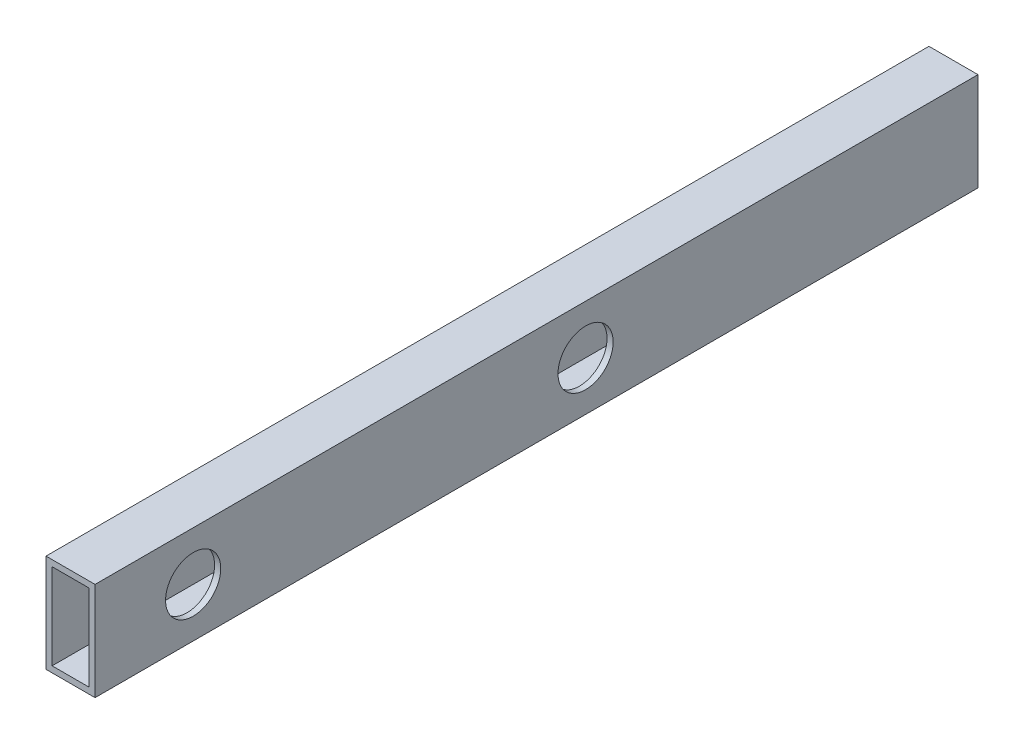
ISO-10303-21;
HEADER;
FILE_DESCRIPTION(('STEP AP214'),'2;1');
FILE_NAME('part.step','',(''),(''),'','','');
FILE_SCHEMA(('AUTOMOTIVE_DESIGN { 1 0 10303 214 1 1 1 1 }'));
ENDSEC;
DATA;
#1=APPLICATION_CONTEXT('core data for automotive mechanical design processes');
#2=APPLICATION_PROTOCOL_DEFINITION('international standard','automotive_design',2000,#1);
#3=PRODUCT_CONTEXT('',#1,'mechanical');
#4=PRODUCT('Part','Part','',(#3));
#5=PRODUCT_RELATED_PRODUCT_CATEGORY('part','',(#4));
#6=PRODUCT_DEFINITION_FORMATION('','',#4);
#7=PRODUCT_DEFINITION_CONTEXT('part definition',#1,'design');
#8=PRODUCT_DEFINITION('design','',#6,#7);
#9=PRODUCT_DEFINITION_SHAPE('','',#8);
#10=(LENGTH_UNIT() NAMED_UNIT(*) SI_UNIT(.MILLI.,.METRE.));
#11=(NAMED_UNIT(*) PLANE_ANGLE_UNIT() SI_UNIT($,.RADIAN.));
#12=(NAMED_UNIT(*) SI_UNIT($,.STERADIAN.) SOLID_ANGLE_UNIT());
#13=UNCERTAINTY_MEASURE_WITH_UNIT(LENGTH_MEASURE(1.E-05),#10,'distance_accuracy_value','');
#14=(GEOMETRIC_REPRESENTATION_CONTEXT(3) GLOBAL_UNCERTAINTY_ASSIGNED_CONTEXT((#13)) GLOBAL_UNIT_ASSIGNED_CONTEXT((#10,
#11,#12)) REPRESENTATION_CONTEXT('',''));
#15=CARTESIAN_POINT('',(0.,0.,0.));
#16=DIRECTION('',(0.,0.,1.));
#17=DIRECTION('',(1.,0.,0.));
#18=AXIS2_PLACEMENT_3D('',#15,#16,#17);
#19=CARTESIAN_POINT('',(0.,0.,457.2));
#20=DIRECTION('',(0.,0.,-1.));
#21=DIRECTION('',(-1.,0.,0.));
#22=AXIS2_PLACEMENT_3D('',#19,#20,#21);
#23=PLANE('',#22);
#24=DIRECTION('',(0.,-1.,0.));
#25=VECTOR('',#24,1.);
#26=CARTESIAN_POINT('',(0.,0.,457.2));
#27=LINE('',#26,#25);
#28=CARTESIAN_POINT('',(0.,50.8,457.2));
#29=VERTEX_POINT('',#28);
#30=CARTESIAN_POINT('',(0.,0.,457.2));
#31=VERTEX_POINT('',#30);
#32=EDGE_CURVE('E138',#29,#31,#27,.T.);
#33=ORIENTED_EDGE('',*,*,#32,.T.);
#34=DIRECTION('',(1.,0.,0.));
#35=VECTOR('',#34,1.);
#36=CARTESIAN_POINT('',(0.,0.,457.2));
#37=LINE('',#36,#35);
#38=CARTESIAN_POINT('',(25.4,0.,457.2));
#39=VERTEX_POINT('',#38);
#40=EDGE_CURVE('E141',#31,#39,#37,.T.);
#41=ORIENTED_EDGE('',*,*,#40,.T.);
#42=DIRECTION('',(0.,1.,0.));
#43=VECTOR('',#42,1.);
#44=CARTESIAN_POINT('',(25.4,0.,457.2));
#45=LINE('',#44,#43);
#46=CARTESIAN_POINT('',(25.4,50.8,457.2));
#47=VERTEX_POINT('',#46);
#48=EDGE_CURVE('E144',#39,#47,#45,.T.);
#49=ORIENTED_EDGE('',*,*,#48,.T.);
#50=DIRECTION('',(-1.,0.,0.));
#51=VECTOR('',#50,1.);
#52=CARTESIAN_POINT('',(0.,50.8,457.2));
#53=LINE('',#52,#51);
#54=EDGE_CURVE('E146',#47,#29,#53,.T.);
#55=ORIENTED_EDGE('',*,*,#54,.T.);
#56=EDGE_LOOP('',(#33,#41,#49,#55));
#57=FACE_BOUND('',#56,.T.);
#58=DIRECTION('',(0.,-1.,0.));
#59=VECTOR('',#58,1.);
#60=CARTESIAN_POINT('',(3.175,3.175,457.2));
#61=LINE('',#60,#59);
#62=CARTESIAN_POINT('',(3.175,47.625,457.2));
#63=VERTEX_POINT('',#62);
#64=CARTESIAN_POINT('',(3.175,3.175,457.2));
#65=VERTEX_POINT('',#64);
#66=EDGE_CURVE('E100',#63,#65,#61,.T.);
#67=ORIENTED_EDGE('',*,*,#66,.F.);
#68=DIRECTION('',(-1.,0.,0.));
#69=VECTOR('',#68,1.);
#70=CARTESIAN_POINT('',(3.175,47.625,457.2));
#71=LINE('',#70,#69);
#72=CARTESIAN_POINT('',(22.225,47.625,457.2));
#73=VERTEX_POINT('',#72);
#74=EDGE_CURVE('E122',#73,#63,#71,.T.);
#75=ORIENTED_EDGE('',*,*,#74,.F.);
#76=DIRECTION('',(0.,1.,0.));
#77=VECTOR('',#76,1.);
#78=CARTESIAN_POINT('',(22.225,3.175,457.2));
#79=LINE('',#78,#77);
#80=CARTESIAN_POINT('',(22.225,3.175,457.2));
#81=VERTEX_POINT('',#80);
#82=EDGE_CURVE('E120',#81,#73,#79,.T.);
#83=ORIENTED_EDGE('',*,*,#82,.F.);
#84=DIRECTION('',(1.,0.,0.));
#85=VECTOR('',#84,1.);
#86=CARTESIAN_POINT('',(3.175,3.175,457.2));
#87=LINE('',#86,#85);
#88=EDGE_CURVE('E108',#65,#81,#87,.T.);
#89=ORIENTED_EDGE('',*,*,#88,.F.);
#90=EDGE_LOOP('',(#67,#75,#83,#89));
#91=FACE_BOUND('',#90,.T.);
#92=ADVANCED_FACE('F33',(#57,#91),#23,.F.);
#93=CARTESIAN_POINT('',(0.,0.,0.));
#94=DIRECTION('',(0.,0.,-1.));
#95=DIRECTION('',(-1.,0.,0.));
#96=AXIS2_PLACEMENT_3D('',#93,#94,#95);
#97=PLANE('',#96);
#98=DIRECTION('',(0.,-1.,0.));
#99=VECTOR('',#98,1.);
#100=CARTESIAN_POINT('',(0.,0.,0.));
#101=LINE('',#100,#99);
#102=CARTESIAN_POINT('',(0.,50.8,0.));
#103=VERTEX_POINT('',#102);
#104=CARTESIAN_POINT('',(0.,0.,0.));
#105=VERTEX_POINT('',#104);
#106=EDGE_CURVE('E116',#103,#105,#101,.T.);
#107=ORIENTED_EDGE('',*,*,#106,.F.);
#108=DIRECTION('',(-1.,0.,0.));
#109=VECTOR('',#108,1.);
#110=CARTESIAN_POINT('',(0.,50.8,0.));
#111=LINE('',#110,#109);
#112=CARTESIAN_POINT('',(25.4,50.8,0.));
#113=VERTEX_POINT('',#112);
#114=EDGE_CURVE('E142',#113,#103,#111,.T.);
#115=ORIENTED_EDGE('',*,*,#114,.F.);
#116=DIRECTION('',(0.,1.,0.));
#117=VECTOR('',#116,1.);
#118=CARTESIAN_POINT('',(25.4,0.,0.));
#119=LINE('',#118,#117);
#120=CARTESIAN_POINT('',(25.4,0.,0.));
#121=VERTEX_POINT('',#120);
#122=EDGE_CURVE('E153',#121,#113,#119,.T.);
#123=ORIENTED_EDGE('',*,*,#122,.F.);
#124=DIRECTION('',(1.,0.,0.));
#125=VECTOR('',#124,1.);
#126=CARTESIAN_POINT('',(0.,0.,0.));
#127=LINE('',#126,#125);
#128=EDGE_CURVE('E151',#105,#121,#127,.T.);
#129=ORIENTED_EDGE('',*,*,#128,.F.);
#130=EDGE_LOOP('',(#107,#115,#123,#129));
#131=FACE_BOUND('',#130,.T.);
#132=DIRECTION('',(-1.,0.,0.));
#133=VECTOR('',#132,1.);
#134=CARTESIAN_POINT('',(3.175,47.625,0.));
#135=LINE('',#134,#133);
#136=CARTESIAN_POINT('',(22.225,47.625,0.));
#137=VERTEX_POINT('',#136);
#138=CARTESIAN_POINT('',(3.175,47.625,0.));
#139=VERTEX_POINT('',#138);
#140=EDGE_CURVE('E109',#137,#139,#135,.T.);
#141=ORIENTED_EDGE('',*,*,#140,.T.);
#142=DIRECTION('',(0.,-1.,0.));
#143=VECTOR('',#142,1.);
#144=CARTESIAN_POINT('',(3.175,3.175,0.));
#145=LINE('',#144,#143);
#146=CARTESIAN_POINT('',(3.175,3.175,0.));
#147=VERTEX_POINT('',#146);
#148=EDGE_CURVE('E58',#139,#147,#145,.T.);
#149=ORIENTED_EDGE('',*,*,#148,.T.);
#150=DIRECTION('',(1.,0.,0.));
#151=VECTOR('',#150,1.);
#152=CARTESIAN_POINT('',(3.175,3.175,0.));
#153=LINE('',#152,#151);
#154=CARTESIAN_POINT('',(22.225,3.175,0.));
#155=VERTEX_POINT('',#154);
#156=EDGE_CURVE('E115',#147,#155,#153,.T.);
#157=ORIENTED_EDGE('',*,*,#156,.T.);
#158=DIRECTION('',(0.,1.,0.));
#159=VECTOR('',#158,1.);
#160=CARTESIAN_POINT('',(22.225,3.175,0.));
#161=LINE('',#160,#159);
#162=EDGE_CURVE('E130',#155,#137,#161,.T.);
#163=ORIENTED_EDGE('',*,*,#162,.T.);
#164=EDGE_LOOP('',(#141,#149,#157,#163));
#165=FACE_BOUND('',#164,.T.);
#166=ADVANCED_FACE('F200',(#131,#165),#97,.T.);
#167=CARTESIAN_POINT('',(0.,0.,457.2));
#168=DIRECTION('',(1.,0.,0.));
#169=DIRECTION('',(0.,0.,-1.));
#170=AXIS2_PLACEMENT_3D('',#167,#168,#169);
#171=PLANE('',#170);
#172=CARTESIAN_POINT('',(0.,25.3999999999971,203.2));
#173=DIRECTION('',(1.,0.,0.));
#174=DIRECTION('',(0.,0.,-1.));
#175=AXIS2_PLACEMENT_3D('',#172,#173,#174);
#176=CIRCLE('',#175,14.2875);
#177=CARTESIAN_POINT('',(0.,25.3999999999971,188.9125));
#178=VERTEX_POINT('',#177);
#179=EDGE_CURVE('E182',#178,#178,#176,.T.);
#180=ORIENTED_EDGE('',*,*,#179,.T.);
#181=EDGE_LOOP('',(#180));
#182=FACE_BOUND('',#181,.T.);
#183=CARTESIAN_POINT('',(0.,25.4,406.4));
#184=DIRECTION('',(1.,0.,0.));
#185=DIRECTION('',(0.,0.,-1.));
#186=AXIS2_PLACEMENT_3D('',#183,#184,#185);
#187=CIRCLE('',#186,14.2875);
#188=CARTESIAN_POINT('',(0.,25.4,392.1125));
#189=VERTEX_POINT('',#188);
#190=EDGE_CURVE('E164',#189,#189,#187,.T.);
#191=ORIENTED_EDGE('',*,*,#190,.T.);
#192=EDGE_LOOP('',(#191));
#193=FACE_BOUND('',#192,.T.);
#194=ORIENTED_EDGE('',*,*,#106,.T.);
#195=DIRECTION('',(0.,0.,-1.));
#196=VECTOR('',#195,1.);
#197=CARTESIAN_POINT('',(0.,0.,457.2));
#198=LINE('',#197,#196);
#199=EDGE_CURVE('E11',#31,#105,#198,.T.);
#200=ORIENTED_EDGE('',*,*,#199,.F.);
#201=ORIENTED_EDGE('',*,*,#32,.F.);
#202=DIRECTION('',(0.,0.,-1.));
#203=VECTOR('',#202,1.);
#204=CARTESIAN_POINT('',(0.,50.8,457.2));
#205=LINE('',#204,#203);
#206=EDGE_CURVE('E148',#29,#103,#205,.T.);
#207=ORIENTED_EDGE('',*,*,#206,.T.);
#208=EDGE_LOOP('',(#194,#200,#201,#207));
#209=FACE_BOUND('',#208,.T.);
#210=ADVANCED_FACE('F35',(#182,#193,#209),#171,.F.);
#211=CARTESIAN_POINT('',(0.,0.,457.2));
#212=DIRECTION('',(0.,1.,0.));
#213=DIRECTION('',(0.,0.,1.));
#214=AXIS2_PLACEMENT_3D('',#211,#212,#213);
#215=PLANE('',#214);
#216=ORIENTED_EDGE('',*,*,#128,.T.);
#217=DIRECTION('',(0.,0.,-1.));
#218=VECTOR('',#217,1.);
#219=CARTESIAN_POINT('',(25.4,0.,457.2));
#220=LINE('',#219,#218);
#221=EDGE_CURVE('E42',#39,#121,#220,.T.);
#222=ORIENTED_EDGE('',*,*,#221,.F.);
#223=ORIENTED_EDGE('',*,*,#40,.F.);
#224=ORIENTED_EDGE('',*,*,#199,.T.);
#225=EDGE_LOOP('',(#216,#222,#223,#224));
#226=FACE_BOUND('',#225,.T.);
#227=ADVANCED_FACE('F227',(#226),#215,.F.);
#228=CARTESIAN_POINT('',(25.4,0.,457.2));
#229=DIRECTION('',(-1.,0.,0.));
#230=DIRECTION('',(0.,0.,1.));
#231=AXIS2_PLACEMENT_3D('',#228,#229,#230);
#232=PLANE('',#231);
#233=CARTESIAN_POINT('',(25.4,25.3999999999971,203.2));
#234=DIRECTION('',(1.,0.,0.));
#235=DIRECTION('',(0.,0.,-1.));
#236=AXIS2_PLACEMENT_3D('',#233,#234,#235);
#237=CIRCLE('',#236,14.2875);
#238=CARTESIAN_POINT('',(25.4,25.3999999999971,188.9125));
#239=VERTEX_POINT('',#238);
#240=EDGE_CURVE('E179',#239,#239,#237,.T.);
#241=ORIENTED_EDGE('',*,*,#240,.F.);
#242=EDGE_LOOP('',(#241));
#243=FACE_BOUND('',#242,.T.);
#244=CARTESIAN_POINT('',(25.4,25.4,406.4));
#245=DIRECTION('',(1.,0.,0.));
#246=DIRECTION('',(0.,0.,-1.));
#247=AXIS2_PLACEMENT_3D('',#244,#245,#246);
#248=CIRCLE('',#247,14.2875);
#249=CARTESIAN_POINT('',(25.4,25.4,392.1125));
#250=VERTEX_POINT('',#249);
#251=EDGE_CURVE('E169',#250,#250,#248,.T.);
#252=ORIENTED_EDGE('',*,*,#251,.F.);
#253=EDGE_LOOP('',(#252));
#254=FACE_BOUND('',#253,.T.);
#255=ORIENTED_EDGE('',*,*,#122,.T.);
#256=DIRECTION('',(0.,0.,-1.));
#257=VECTOR('',#256,1.);
#258=CARTESIAN_POINT('',(25.4,50.8,457.2));
#259=LINE('',#258,#257);
#260=EDGE_CURVE('E158',#47,#113,#259,.T.);
#261=ORIENTED_EDGE('',*,*,#260,.F.);
#262=ORIENTED_EDGE('',*,*,#48,.F.);
#263=ORIENTED_EDGE('',*,*,#221,.T.);
#264=EDGE_LOOP('',(#255,#261,#262,#263));
#265=FACE_BOUND('',#264,.T.);
#266=ADVANCED_FACE('F224',(#243,#254,#265),#232,.F.);
#267=CARTESIAN_POINT('',(0.,50.8,457.2));
#268=DIRECTION('',(0.,-1.,0.));
#269=DIRECTION('',(0.,0.,-1.));
#270=AXIS2_PLACEMENT_3D('',#267,#268,#269);
#271=PLANE('',#270);
#272=ORIENTED_EDGE('',*,*,#114,.T.);
#273=ORIENTED_EDGE('',*,*,#206,.F.);
#274=ORIENTED_EDGE('',*,*,#54,.F.);
#275=ORIENTED_EDGE('',*,*,#260,.T.);
#276=EDGE_LOOP('',(#272,#273,#274,#275));
#277=FACE_BOUND('',#276,.T.);
#278=ADVANCED_FACE('F221',(#277),#271,.F.);
#279=CARTESIAN_POINT('',(3.175,3.175,457.2));
#280=DIRECTION('',(1.,0.,0.));
#281=DIRECTION('',(0.,0.,-1.));
#282=AXIS2_PLACEMENT_3D('',#279,#280,#281);
#283=PLANE('',#282);
#284=CARTESIAN_POINT('',(3.175,25.3999999999971,203.2));
#285=DIRECTION('',(1.,0.,0.));
#286=DIRECTION('',(0.,0.,-1.));
#287=AXIS2_PLACEMENT_3D('',#284,#285,#286);
#288=CIRCLE('',#287,14.2875);
#289=CARTESIAN_POINT('',(3.175,25.3999999999971,188.9125));
#290=VERTEX_POINT('',#289);
#291=EDGE_CURVE('E174',#290,#290,#288,.T.);
#292=ORIENTED_EDGE('',*,*,#291,.F.);
#293=EDGE_LOOP('',(#292));
#294=FACE_BOUND('',#293,.T.);
#295=CARTESIAN_POINT('',(3.175,25.4,406.4));
#296=DIRECTION('',(1.,0.,0.));
#297=DIRECTION('',(0.,0.,-1.));
#298=AXIS2_PLACEMENT_3D('',#295,#296,#297);
#299=CIRCLE('',#298,14.2875);
#300=CARTESIAN_POINT('',(3.175,25.4,392.1125));
#301=VERTEX_POINT('',#300);
#302=EDGE_CURVE('E128',#301,#301,#299,.T.);
#303=ORIENTED_EDGE('',*,*,#302,.F.);
#304=EDGE_LOOP('',(#303));
#305=FACE_BOUND('',#304,.T.);
#306=ORIENTED_EDGE('',*,*,#148,.F.);
#307=DIRECTION('',(0.,0.,-1.));
#308=VECTOR('',#307,1.);
#309=CARTESIAN_POINT('',(3.175,47.625,457.2));
#310=LINE('',#309,#308);
#311=EDGE_CURVE('E104',#63,#139,#310,.T.);
#312=ORIENTED_EDGE('',*,*,#311,.F.);
#313=ORIENTED_EDGE('',*,*,#66,.T.);
#314=DIRECTION('',(0.,0.,-1.));
#315=VECTOR('',#314,1.);
#316=CARTESIAN_POINT('',(3.175,3.175,457.2));
#317=LINE('',#316,#315);
#318=EDGE_CURVE('E103',#65,#147,#317,.T.);
#319=ORIENTED_EDGE('',*,*,#318,.T.);
#320=EDGE_LOOP('',(#306,#312,#313,#319));
#321=FACE_BOUND('',#320,.T.);
#322=ADVANCED_FACE('F102',(#294,#305,#321),#283,.T.);
#323=CARTESIAN_POINT('',(3.175,3.175,457.2));
#324=DIRECTION('',(0.,1.,0.));
#325=DIRECTION('',(0.,0.,1.));
#326=AXIS2_PLACEMENT_3D('',#323,#324,#325);
#327=PLANE('',#326);
#328=ORIENTED_EDGE('',*,*,#156,.F.);
#329=ORIENTED_EDGE('',*,*,#318,.F.);
#330=ORIENTED_EDGE('',*,*,#88,.T.);
#331=DIRECTION('',(0.,0.,-1.));
#332=VECTOR('',#331,1.);
#333=CARTESIAN_POINT('',(22.225,3.175,457.2));
#334=LINE('',#333,#332);
#335=EDGE_CURVE('E117',#81,#155,#334,.T.);
#336=ORIENTED_EDGE('',*,*,#335,.T.);
#337=EDGE_LOOP('',(#328,#329,#330,#336));
#338=FACE_BOUND('',#337,.T.);
#339=ADVANCED_FACE('F112',(#338),#327,.T.);
#340=CARTESIAN_POINT('',(22.225,3.175,457.2));
#341=DIRECTION('',(-1.,0.,0.));
#342=DIRECTION('',(0.,0.,1.));
#343=AXIS2_PLACEMENT_3D('',#340,#341,#342);
#344=PLANE('',#343);
#345=CARTESIAN_POINT('',(22.225,25.3999999999971,203.2));
#346=DIRECTION('',(-1.,0.,0.));
#347=DIRECTION('',(0.,0.,1.));
#348=AXIS2_PLACEMENT_3D('',#345,#346,#347);
#349=CIRCLE('',#348,14.2875);
#350=CARTESIAN_POINT('',(22.225,25.3999999999971,217.4875));
#351=VERTEX_POINT('',#350);
#352=EDGE_CURVE('E37',#351,#351,#349,.T.);
#353=ORIENTED_EDGE('',*,*,#352,.F.);
#354=EDGE_LOOP('',(#353));
#355=FACE_BOUND('',#354,.T.);
#356=CARTESIAN_POINT('',(22.225,25.4,406.4));
#357=DIRECTION('',(-1.,0.,0.));
#358=DIRECTION('',(0.,0.,1.));
#359=AXIS2_PLACEMENT_3D('',#356,#357,#358);
#360=CIRCLE('',#359,14.2875);
#361=CARTESIAN_POINT('',(22.225,25.4,420.6875));
#362=VERTEX_POINT('',#361);
#363=EDGE_CURVE('E162',#362,#362,#360,.T.);
#364=ORIENTED_EDGE('',*,*,#363,.F.);
#365=EDGE_LOOP('',(#364));
#366=FACE_BOUND('',#365,.T.);
#367=ORIENTED_EDGE('',*,*,#162,.F.);
#368=ORIENTED_EDGE('',*,*,#335,.F.);
#369=ORIENTED_EDGE('',*,*,#82,.T.);
#370=DIRECTION('',(0.,0.,-1.));
#371=VECTOR('',#370,1.);
#372=CARTESIAN_POINT('',(22.225,47.625,457.2));
#373=LINE('',#372,#371);
#374=EDGE_CURVE('E50',#73,#137,#373,.T.);
#375=ORIENTED_EDGE('',*,*,#374,.T.);
#376=EDGE_LOOP('',(#367,#368,#369,#375));
#377=FACE_BOUND('',#376,.T.);
#378=ADVANCED_FACE('F192',(#355,#366,#377),#344,.T.);
#379=CARTESIAN_POINT('',(3.175,47.625,457.2));
#380=DIRECTION('',(0.,-1.,0.));
#381=DIRECTION('',(0.,0.,-1.));
#382=AXIS2_PLACEMENT_3D('',#379,#380,#381);
#383=PLANE('',#382);
#384=ORIENTED_EDGE('',*,*,#140,.F.);
#385=ORIENTED_EDGE('',*,*,#374,.F.);
#386=ORIENTED_EDGE('',*,*,#74,.T.);
#387=ORIENTED_EDGE('',*,*,#311,.T.);
#388=EDGE_LOOP('',(#384,#385,#386,#387));
#389=FACE_BOUND('',#388,.T.);
#390=ADVANCED_FACE('F195',(#389),#383,.T.);
#391=CARTESIAN_POINT('',(0.,25.4,406.4));
#392=DIRECTION('',(1.,0.,0.));
#393=DIRECTION('',(0.,0.,-1.));
#394=AXIS2_PLACEMENT_3D('',#391,#392,#393);
#395=CYLINDRICAL_SURFACE('',#394,14.2875);
#396=ORIENTED_EDGE('',*,*,#363,.T.);
#397=EDGE_LOOP('',(#396));
#398=FACE_BOUND('',#397,.T.);
#399=ORIENTED_EDGE('',*,*,#251,.T.);
#400=EDGE_LOOP('',(#399));
#401=FACE_BOUND('',#400,.T.);
#402=ADVANCED_FACE('F202',(#398,#401),#395,.F.);
#403=ORIENTED_EDGE('',*,*,#302,.T.);
#404=EDGE_LOOP('',(#403));
#405=FACE_BOUND('',#404,.T.);
#406=ORIENTED_EDGE('',*,*,#190,.F.);
#407=EDGE_LOOP('',(#406));
#408=FACE_BOUND('',#407,.T.);
#409=ADVANCED_FACE('F208',(#405,#408),#395,.F.);
#410=CARTESIAN_POINT('',(0.,25.3999999999971,203.2));
#411=DIRECTION('',(1.,0.,0.));
#412=DIRECTION('',(0.,0.,-1.));
#413=AXIS2_PLACEMENT_3D('',#410,#411,#412);
#414=CYLINDRICAL_SURFACE('',#413,14.2875);
#415=ORIENTED_EDGE('',*,*,#352,.T.);
#416=EDGE_LOOP('',(#415));
#417=FACE_BOUND('',#416,.T.);
#418=ORIENTED_EDGE('',*,*,#240,.T.);
#419=EDGE_LOOP('',(#418));
#420=FACE_BOUND('',#419,.T.);
#421=ADVANCED_FACE('F189',(#417,#420),#414,.F.);
#422=ORIENTED_EDGE('',*,*,#291,.T.);
#423=EDGE_LOOP('',(#422));
#424=FACE_BOUND('',#423,.T.);
#425=ORIENTED_EDGE('',*,*,#179,.F.);
#426=EDGE_LOOP('',(#425));
#427=FACE_BOUND('',#426,.T.);
#428=ADVANCED_FACE('F286',(#424,#427),#414,.F.);
#429=CLOSED_SHELL('',(#92,#166,#210,#227,#266,#278,#322,#339,#378,#390,#402,#409,#421,#428));
#430=MANIFOLD_SOLID_BREP('B2',#429);
#431=ADVANCED_BREP_SHAPE_REPRESENTATION('',(#18,#430),#14);
#432=SHAPE_DEFINITION_REPRESENTATION(#9,#431);
ENDSEC;
END-ISO-10303-21;
